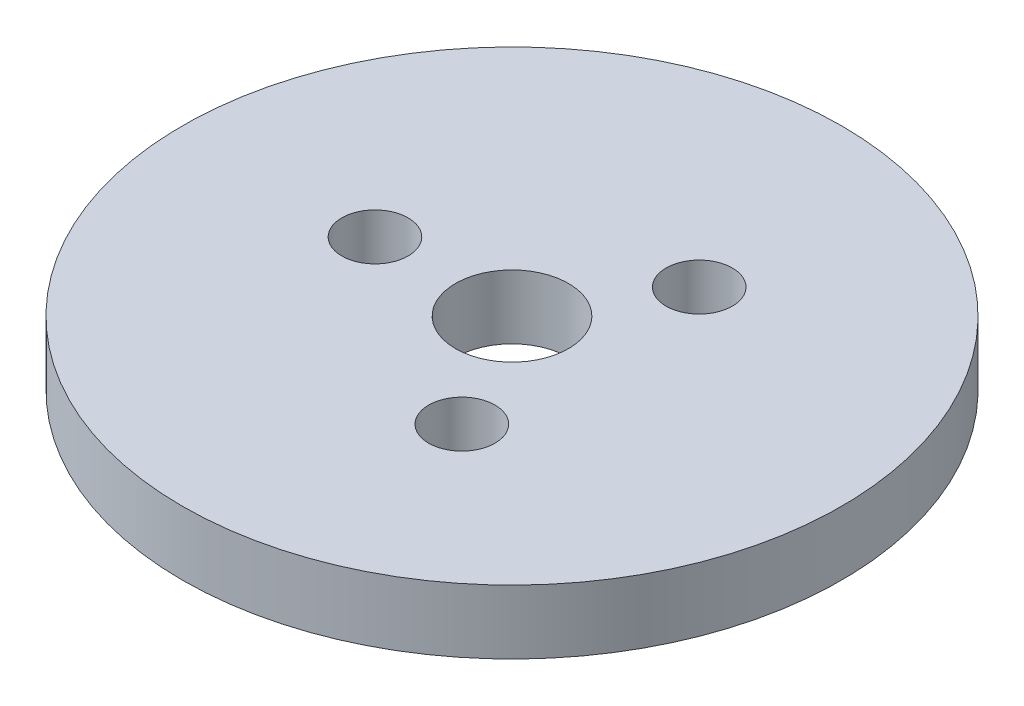
ISO-10303-21;
HEADER;
FILE_DESCRIPTION(('STEP AP214'),'2;1');
FILE_NAME('part.step','',(''),(''),'','','');
FILE_SCHEMA(('AUTOMOTIVE_DESIGN { 1 0 10303 214 1 1 1 1 }'));
ENDSEC;
DATA;
#1=APPLICATION_CONTEXT('core data for automotive mechanical design processes');
#2=APPLICATION_PROTOCOL_DEFINITION('international standard','automotive_design',2000,#1);
#3=PRODUCT_CONTEXT('',#1,'mechanical');
#4=PRODUCT('Part','Part','',(#3));
#5=PRODUCT_RELATED_PRODUCT_CATEGORY('part','',(#4));
#6=PRODUCT_DEFINITION_FORMATION('','',#4);
#7=PRODUCT_DEFINITION_CONTEXT('part definition',#1,'design');
#8=PRODUCT_DEFINITION('design','',#6,#7);
#9=PRODUCT_DEFINITION_SHAPE('','',#8);
#10=(LENGTH_UNIT() NAMED_UNIT(*) SI_UNIT(.MILLI.,.METRE.));
#11=(NAMED_UNIT(*) PLANE_ANGLE_UNIT() SI_UNIT($,.RADIAN.));
#12=(NAMED_UNIT(*) SI_UNIT($,.STERADIAN.) SOLID_ANGLE_UNIT());
#13=UNCERTAINTY_MEASURE_WITH_UNIT(LENGTH_MEASURE(1.E-05),#10,'distance_accuracy_value','');
#14=(GEOMETRIC_REPRESENTATION_CONTEXT(3) GLOBAL_UNCERTAINTY_ASSIGNED_CONTEXT((#13)) GLOBAL_UNIT_ASSIGNED_CONTEXT((#10,
#11,#12)) REPRESENTATION_CONTEXT('',''));
#15=CARTESIAN_POINT('',(0.,0.,0.));
#16=DIRECTION('',(0.,0.,1.));
#17=DIRECTION('',(1.,0.,0.));
#18=AXIS2_PLACEMENT_3D('',#15,#16,#17);
#19=CARTESIAN_POINT('',(0.,17.,0.));
#20=DIRECTION('',(0.,-1.,0.));
#21=DIRECTION('',(0.,0.,-1.));
#22=AXIS2_PLACEMENT_3D('',#19,#20,#21);
#23=CYLINDRICAL_SURFACE('',#22,87.5);
#24=CARTESIAN_POINT('',(0.,17.,0.));
#25=DIRECTION('',(0.,1.,0.));
#26=DIRECTION('',(0.,0.,1.));
#27=AXIS2_PLACEMENT_3D('',#24,#25,#26);
#28=CIRCLE('',#27,87.5);
#29=CARTESIAN_POINT('',(0.,17.,87.5));
#30=VERTEX_POINT('',#29);
#31=EDGE_CURVE('E10',#30,#30,#28,.T.);
#32=ORIENTED_EDGE('',*,*,#31,.F.);
#33=EDGE_LOOP('',(#32));
#34=FACE_BOUND('',#33,.T.);
#35=CARTESIAN_POINT('',(0.,0.,0.));
#36=DIRECTION('',(0.,1.,0.));
#37=DIRECTION('',(0.,0.,1.));
#38=AXIS2_PLACEMENT_3D('',#35,#36,#37);
#39=CIRCLE('',#38,87.5);
#40=CARTESIAN_POINT('',(0.,0.,87.5));
#41=VERTEX_POINT('',#40);
#42=EDGE_CURVE('E37',#41,#41,#39,.T.);
#43=ORIENTED_EDGE('',*,*,#42,.T.);
#44=EDGE_LOOP('',(#43));
#45=FACE_BOUND('',#44,.T.);
#46=ADVANCED_FACE('F40',(#34,#45),#23,.T.);
#47=CARTESIAN_POINT('',(0.,17.,0.));
#48=DIRECTION('',(0.,1.,0.));
#49=DIRECTION('',(0.,0.,1.));
#50=AXIS2_PLACEMENT_3D('',#47,#48,#49);
#51=PLANE('',#50);
#52=CARTESIAN_POINT('',(18.1937907618549,17.,31.5125699818097));
#53=DIRECTION('',(0.,1.,0.));
#54=DIRECTION('',(0.866025403784436,0.,-0.500000000000004));
#55=AXIS2_PLACEMENT_3D('',#52,#53,#54);
#56=CIRCLE('',#55,8.79148987192561);
#57=CARTESIAN_POINT('',(25.8074443280561,17.,27.1168250458468));
#58=VERTEX_POINT('',#57);
#59=EDGE_CURVE('E70',#58,#58,#56,.T.);
#60=ORIENTED_EDGE('',*,*,#59,.F.);
#61=EDGE_LOOP('',(#60));
#62=FACE_BOUND('',#61,.T.);
#63=CARTESIAN_POINT('',(18.1937907618545,17.,-31.5125699818099));
#64=DIRECTION('',(0.,1.,0.));
#65=DIRECTION('',(-0.866025403784443,0.,-0.499999999999992));
#66=AXIS2_PLACEMENT_3D('',#63,#64,#65);
#67=CIRCLE('',#66,8.79148987192561);
#68=CARTESIAN_POINT('',(10.5801371956533,17.,-35.9083149177726));
#69=VERTEX_POINT('',#68);
#70=EDGE_CURVE('E61',#69,#69,#67,.T.);
#71=ORIENTED_EDGE('',*,*,#70,.F.);
#72=EDGE_LOOP('',(#71));
#73=FACE_BOUND('',#72,.T.);
#74=CARTESIAN_POINT('',(-36.3875815237095,17.,0.));
#75=DIRECTION('',(0.,1.,0.));
#76=DIRECTION('',(0.,0.,1.));
#77=AXIS2_PLACEMENT_3D('',#74,#75,#76);
#78=CIRCLE('',#77,8.79148987192561);
#79=CARTESIAN_POINT('',(-36.3875815237095,17.,8.79148987192561));
#80=VERTEX_POINT('',#79);
#81=EDGE_CURVE('E54',#80,#80,#78,.T.);
#82=ORIENTED_EDGE('',*,*,#81,.F.);
#83=EDGE_LOOP('',(#82));
#84=FACE_BOUND('',#83,.T.);
#85=CARTESIAN_POINT('',(0.,17.,0.));
#86=DIRECTION('',(0.,1.,0.));
#87=DIRECTION('',(0.,0.,1.));
#88=AXIS2_PLACEMENT_3D('',#85,#86,#87);
#89=CIRCLE('',#88,15.);
#90=CARTESIAN_POINT('',(0.,17.,15.));
#91=VERTEX_POINT('',#90);
#92=EDGE_CURVE('E50',#91,#91,#89,.T.);
#93=ORIENTED_EDGE('',*,*,#92,.F.);
#94=EDGE_LOOP('',(#93));
#95=FACE_BOUND('',#94,.T.);
#96=ORIENTED_EDGE('',*,*,#31,.T.);
#97=EDGE_LOOP('',(#96));
#98=FACE_BOUND('',#97,.T.);
#99=ADVANCED_FACE('F85',(#62,#73,#84,#95,#98),#51,.T.);
#100=CARTESIAN_POINT('',(0.,0.,0.));
#101=DIRECTION('',(0.,1.,0.));
#102=DIRECTION('',(0.,0.,1.));
#103=AXIS2_PLACEMENT_3D('',#100,#101,#102);
#104=PLANE('',#103);
#105=CARTESIAN_POINT('',(0.,0.,0.));
#106=DIRECTION('',(0.,1.,0.));
#107=DIRECTION('',(0.,0.,1.));
#108=AXIS2_PLACEMENT_3D('',#105,#106,#107);
#109=CIRCLE('',#108,15.);
#110=CARTESIAN_POINT('',(0.,0.,15.));
#111=VERTEX_POINT('',#110);
#112=EDGE_CURVE('E47',#111,#111,#109,.T.);
#113=ORIENTED_EDGE('',*,*,#112,.T.);
#114=EDGE_LOOP('',(#113));
#115=FACE_BOUND('',#114,.T.);
#116=ORIENTED_EDGE('',*,*,#42,.F.);
#117=EDGE_LOOP('',(#116));
#118=FACE_BOUND('',#117,.T.);
#119=ADVANCED_FACE('F84',(#115,#118),#104,.F.);
#120=CARTESIAN_POINT('',(0.,17.,0.));
#121=DIRECTION('',(0.,-1.,0.));
#122=DIRECTION('',(0.,0.,-1.));
#123=AXIS2_PLACEMENT_3D('',#120,#121,#122);
#124=CYLINDRICAL_SURFACE('',#123,15.);
#125=ORIENTED_EDGE('',*,*,#92,.T.);
#126=EDGE_LOOP('',(#125));
#127=FACE_BOUND('',#126,.T.);
#128=ORIENTED_EDGE('',*,*,#112,.F.);
#129=EDGE_LOOP('',(#128));
#130=FACE_BOUND('',#129,.T.);
#131=ADVANCED_FACE('F91',(#127,#130),#124,.F.);
#132=CARTESIAN_POINT('',(-36.3875815237095,2.23647321174813,0.));
#133=DIRECTION('',(0.,1.,0.));
#134=DIRECTION('',(0.,0.,1.));
#135=AXIS2_PLACEMENT_3D('',#132,#133,#134);
#136=CYLINDRICAL_SURFACE('',#135,8.79148987192561);
#137=CARTESIAN_POINT('',(-36.3875815237095,2.23647321174813,0.));
#138=DIRECTION('',(0.,1.,0.));
#139=DIRECTION('',(0.,0.,1.));
#140=AXIS2_PLACEMENT_3D('',#137,#138,#139);
#141=CIRCLE('',#140,8.79148987192561);
#142=CARTESIAN_POINT('',(-36.3875815237095,2.23647321174813,8.79148987192561));
#143=VERTEX_POINT('',#142);
#144=EDGE_CURVE('E55',#143,#143,#141,.T.);
#145=ORIENTED_EDGE('',*,*,#144,.F.);
#146=EDGE_LOOP('',(#145));
#147=FACE_BOUND('',#146,.T.);
#148=ORIENTED_EDGE('',*,*,#81,.T.);
#149=EDGE_LOOP('',(#148));
#150=FACE_BOUND('',#149,.T.);
#151=ADVANCED_FACE('F96',(#147,#150),#136,.F.);
#152=CARTESIAN_POINT('',(-36.3875815237095,2.23647321174813,0.));
#153=DIRECTION('',(0.,1.,0.));
#154=DIRECTION('',(0.,0.,1.));
#155=AXIS2_PLACEMENT_3D('',#152,#153,#154);
#156=PLANE('',#155);
#157=ORIENTED_EDGE('',*,*,#144,.T.);
#158=EDGE_LOOP('',(#157));
#159=FACE_BOUND('',#158,.T.);
#160=ADVANCED_FACE('F127',(#159),#156,.T.);
#161=CARTESIAN_POINT('',(18.1937907618545,2.23647321174813,-31.5125699818099));
#162=DIRECTION('',(0.,1.,0.));
#163=DIRECTION('',(0.,0.,1.));
#164=AXIS2_PLACEMENT_3D('',#161,#162,#163);
#165=CYLINDRICAL_SURFACE('',#164,8.79148987192561);
#166=CARTESIAN_POINT('',(18.1937907618545,2.23647321174813,-31.5125699818099));
#167=DIRECTION('',(0.,1.,0.));
#168=DIRECTION('',(-0.866025403784443,0.,-0.499999999999992));
#169=AXIS2_PLACEMENT_3D('',#166,#167,#168);
#170=CIRCLE('',#169,8.79148987192561);
#171=CARTESIAN_POINT('',(10.5801371956533,2.23647321174813,-35.9083149177726));
#172=VERTEX_POINT('',#171);
#173=EDGE_CURVE('E63',#172,#172,#170,.T.);
#174=ORIENTED_EDGE('',*,*,#173,.F.);
#175=EDGE_LOOP('',(#174));
#176=FACE_BOUND('',#175,.T.);
#177=ORIENTED_EDGE('',*,*,#70,.T.);
#178=EDGE_LOOP('',(#177));
#179=FACE_BOUND('',#178,.T.);
#180=ADVANCED_FACE('F133',(#176,#179),#165,.F.);
#181=CARTESIAN_POINT('',(18.1937907618545,2.23647321174813,-31.5125699818099));
#182=DIRECTION('',(0.,1.,0.));
#183=DIRECTION('',(-0.866025403784443,0.,-0.499999999999992));
#184=AXIS2_PLACEMENT_3D('',#181,#182,#183);
#185=PLANE('',#184);
#186=ORIENTED_EDGE('',*,*,#173,.T.);
#187=EDGE_LOOP('',(#186));
#188=FACE_BOUND('',#187,.T.);
#189=ADVANCED_FACE('F77',(#188),#185,.T.);
#190=CARTESIAN_POINT('',(18.1937907618549,2.23647321174813,31.5125699818097));
#191=DIRECTION('',(0.,1.,0.));
#192=DIRECTION('',(0.,0.,1.));
#193=AXIS2_PLACEMENT_3D('',#190,#191,#192);
#194=CYLINDRICAL_SURFACE('',#193,8.79148987192561);
#195=CARTESIAN_POINT('',(18.1937907618549,2.23647321174813,31.5125699818097));
#196=DIRECTION('',(0.,1.,0.));
#197=DIRECTION('',(0.866025403784436,0.,-0.500000000000004));
#198=AXIS2_PLACEMENT_3D('',#195,#196,#197);
#199=CIRCLE('',#198,8.79148987192561);
#200=CARTESIAN_POINT('',(25.8074443280561,2.23647321174813,27.1168250458468));
#201=VERTEX_POINT('',#200);
#202=EDGE_CURVE('E59',#201,#201,#199,.T.);
#203=ORIENTED_EDGE('',*,*,#202,.F.);
#204=EDGE_LOOP('',(#203));
#205=FACE_BOUND('',#204,.T.);
#206=ORIENTED_EDGE('',*,*,#59,.T.);
#207=EDGE_LOOP('',(#206));
#208=FACE_BOUND('',#207,.T.);
#209=ADVANCED_FACE('F73',(#205,#208),#194,.F.);
#210=CARTESIAN_POINT('',(18.1937907618549,2.23647321174813,31.5125699818097));
#211=DIRECTION('',(0.,1.,0.));
#212=DIRECTION('',(0.866025403784436,0.,-0.500000000000004));
#213=AXIS2_PLACEMENT_3D('',#210,#211,#212);
#214=PLANE('',#213);
#215=ORIENTED_EDGE('',*,*,#202,.T.);
#216=EDGE_LOOP('',(#215));
#217=FACE_BOUND('',#216,.T.);
#218=ADVANCED_FACE('F71',(#217),#214,.T.);
#219=CLOSED_SHELL('',(#46,#99,#119,#131,#151,#160,#180,#189,#209,#218));
#220=MANIFOLD_SOLID_BREP('B2',#219);
#221=ADVANCED_BREP_SHAPE_REPRESENTATION('',(#18,#220),#14);
#222=SHAPE_DEFINITION_REPRESENTATION(#9,#221);
ENDSEC;
END-ISO-10303-21;
